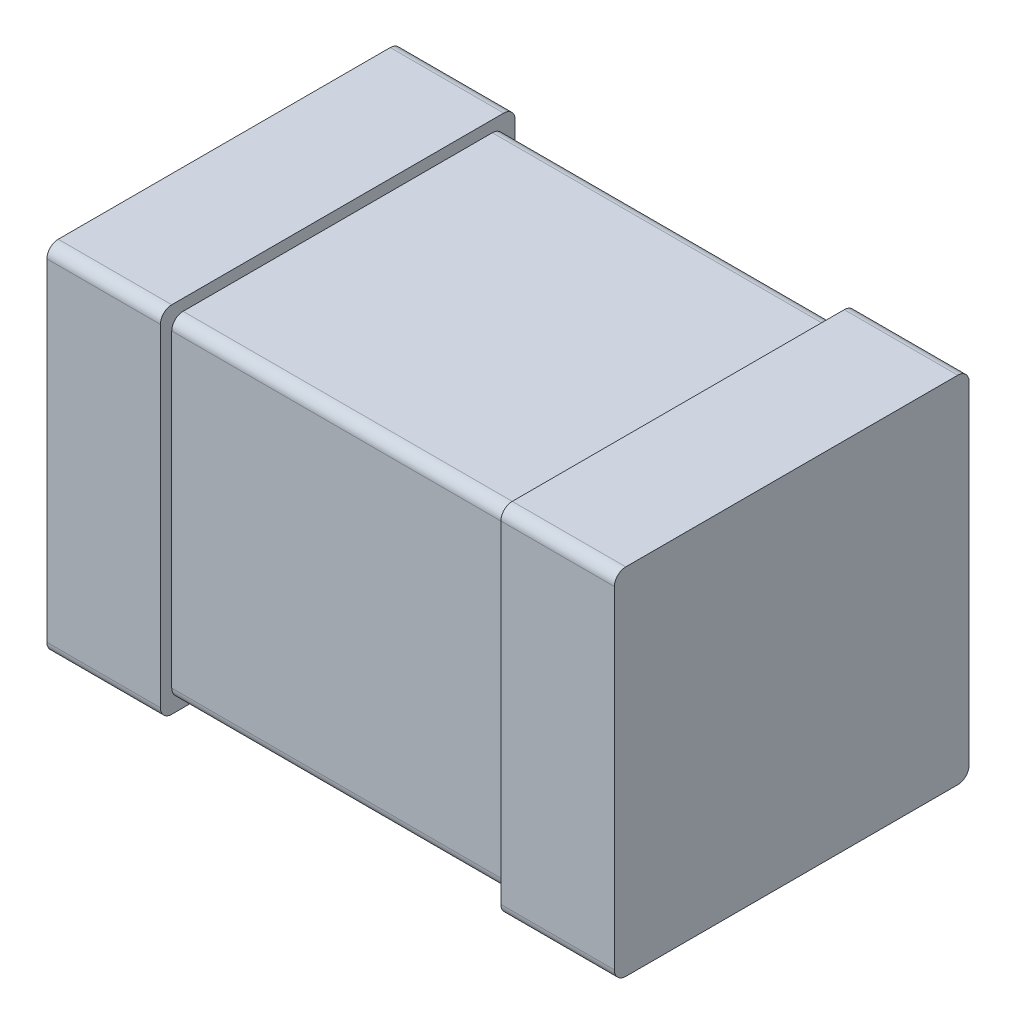
ISO-10303-21;
HEADER;
FILE_DESCRIPTION(('STEP AP214'),'2;1');
FILE_NAME('part.step','',(''),(''),'','','');
FILE_SCHEMA(('AUTOMOTIVE_DESIGN { 1 0 10303 214 1 1 1 1 }'));
ENDSEC;
DATA;
#1=APPLICATION_CONTEXT('core data for automotive mechanical design processes');
#2=APPLICATION_PROTOCOL_DEFINITION('international standard','automotive_design',2000,#1);
#3=PRODUCT_CONTEXT('',#1,'mechanical');
#4=PRODUCT('Part','Part','',(#3));
#5=PRODUCT_RELATED_PRODUCT_CATEGORY('part','',(#4));
#6=PRODUCT_DEFINITION_FORMATION('','',#4);
#7=PRODUCT_DEFINITION_CONTEXT('part definition',#1,'design');
#8=PRODUCT_DEFINITION('design','',#6,#7);
#9=PRODUCT_DEFINITION_SHAPE('','',#8);
#10=(LENGTH_UNIT() NAMED_UNIT(*) SI_UNIT(.MILLI.,.METRE.));
#11=(NAMED_UNIT(*) PLANE_ANGLE_UNIT() SI_UNIT($,.RADIAN.));
#12=(NAMED_UNIT(*) SI_UNIT($,.STERADIAN.) SOLID_ANGLE_UNIT());
#13=UNCERTAINTY_MEASURE_WITH_UNIT(LENGTH_MEASURE(1.E-05),#10,'distance_accuracy_value','');
#14=(GEOMETRIC_REPRESENTATION_CONTEXT(3) GLOBAL_UNCERTAINTY_ASSIGNED_CONTEXT((#13)) GLOBAL_UNIT_ASSIGNED_CONTEXT((#10,
#11,#12)) REPRESENTATION_CONTEXT('',''));
#15=CARTESIAN_POINT('',(0.,0.,0.));
#16=DIRECTION('',(0.,0.,1.));
#17=DIRECTION('',(1.,0.,0.));
#18=AXIS2_PLACEMENT_3D('',#15,#16,#17);
#19=CARTESIAN_POINT('',(-1.,-0.625,0.));
#20=DIRECTION('',(1.,0.,0.));
#21=DIRECTION('',(0.,0.,1.));
#22=AXIS2_PLACEMENT_3D('',#19,#20,#21);
#23=PLANE('',#22);
#24=CARTESIAN_POINT('',(-1.,-0.585,1.21));
#25=DIRECTION('',(-1.,0.,0.));
#26=DIRECTION('',(0.,0.,1.));
#27=AXIS2_PLACEMENT_3D('',#24,#25,#26);
#28=CIRCLE('',#27,0.04);
#29=CARTESIAN_POINT('',(-1.,-0.625,1.21));
#30=VERTEX_POINT('',#29);
#31=CARTESIAN_POINT('',(-1.,-0.585,1.25));
#32=VERTEX_POINT('',#31);
#33=EDGE_CURVE('E11',#30,#32,#28,.T.);
#34=ORIENTED_EDGE('',*,*,#33,.T.);
#35=DIRECTION('',(0.,1.,0.));
#36=VECTOR('',#35,1.);
#37=CARTESIAN_POINT('',(-1.,-0.625,1.25));
#38=LINE('',#37,#36);
#39=CARTESIAN_POINT('',(-1.,0.585,1.25));
#40=VERTEX_POINT('',#39);
#41=EDGE_CURVE('E25',#32,#40,#38,.T.);
#42=ORIENTED_EDGE('',*,*,#41,.T.);
#43=CARTESIAN_POINT('',(-1.,0.585,1.21));
#44=DIRECTION('',(1.,0.,0.));
#45=DIRECTION('',(0.,0.,1.));
#46=AXIS2_PLACEMENT_3D('',#43,#44,#45);
#47=CIRCLE('',#46,0.04);
#48=CARTESIAN_POINT('',(-1.,0.625,1.21));
#49=VERTEX_POINT('',#48);
#50=EDGE_CURVE('E450',#49,#40,#47,.T.);
#51=ORIENTED_EDGE('',*,*,#50,.F.);
#52=DIRECTION('',(0.,0.,1.));
#53=VECTOR('',#52,1.);
#54=CARTESIAN_POINT('',(-1.,0.625,0.));
#55=LINE('',#54,#53);
#56=CARTESIAN_POINT('',(-1.,0.625,0.04));
#57=VERTEX_POINT('',#56);
#58=EDGE_CURVE('E445',#57,#49,#55,.T.);
#59=ORIENTED_EDGE('',*,*,#58,.F.);
#60=CARTESIAN_POINT('',(-1.,0.585,0.04));
#61=DIRECTION('',(-1.,0.,0.));
#62=DIRECTION('',(0.,0.,1.));
#63=AXIS2_PLACEMENT_3D('',#60,#61,#62);
#64=CIRCLE('',#63,0.04);
#65=CARTESIAN_POINT('',(-1.,0.585,0.));
#66=VERTEX_POINT('',#65);
#67=EDGE_CURVE('E441',#57,#66,#64,.T.);
#68=ORIENTED_EDGE('',*,*,#67,.T.);
#69=DIRECTION('',(0.,1.,0.));
#70=VECTOR('',#69,1.);
#71=CARTESIAN_POINT('',(-1.,-0.625,0.));
#72=LINE('',#71,#70);
#73=CARTESIAN_POINT('',(-1.,-0.585,0.));
#74=VERTEX_POINT('',#73);
#75=EDGE_CURVE('E436',#74,#66,#72,.T.);
#76=ORIENTED_EDGE('',*,*,#75,.F.);
#77=CARTESIAN_POINT('',(-1.,-0.585,0.04));
#78=DIRECTION('',(1.,0.,0.));
#79=DIRECTION('',(0.,0.,1.));
#80=AXIS2_PLACEMENT_3D('',#77,#78,#79);
#81=CIRCLE('',#80,0.04);
#82=CARTESIAN_POINT('',(-1.,-0.625,0.04));
#83=VERTEX_POINT('',#82);
#84=EDGE_CURVE('E431',#83,#74,#81,.T.);
#85=ORIENTED_EDGE('',*,*,#84,.F.);
#86=DIRECTION('',(0.,0.,1.));
#87=VECTOR('',#86,1.);
#88=CARTESIAN_POINT('',(-1.,-0.625,0.));
#89=LINE('',#88,#87);
#90=EDGE_CURVE('E427',#83,#30,#89,.T.);
#91=ORIENTED_EDGE('',*,*,#90,.T.);
#92=EDGE_LOOP('',(#34,#42,#51,#59,#68,#76,#85,#91));
#93=FACE_BOUND('',#92,.T.);
#94=ADVANCED_FACE('F17',(#93),#23,.F.);
#95=CARTESIAN_POINT('',(-1.,-0.625,0.));
#96=DIRECTION('',(0.,1.,0.));
#97=DIRECTION('',(0.,0.,1.));
#98=AXIS2_PLACEMENT_3D('',#95,#96,#97);
#99=PLANE('',#98);
#100=DIRECTION('',(1.,0.,0.));
#101=VECTOR('',#100,1.);
#102=CARTESIAN_POINT('',(-1.,-0.625,1.21));
#103=LINE('',#102,#101);
#104=CARTESIAN_POINT('',(-0.6,-0.625,1.21));
#105=VERTEX_POINT('',#104);
#106=EDGE_CURVE('E422',#30,#105,#103,.T.);
#107=ORIENTED_EDGE('',*,*,#106,.F.);
#108=ORIENTED_EDGE('',*,*,#90,.F.);
#109=DIRECTION('',(1.,0.,0.));
#110=VECTOR('',#109,1.);
#111=CARTESIAN_POINT('',(-1.,-0.625,0.04));
#112=LINE('',#111,#110);
#113=CARTESIAN_POINT('',(-0.6,-0.625,0.04));
#114=VERTEX_POINT('',#113);
#115=EDGE_CURVE('E418',#83,#114,#112,.T.);
#116=ORIENTED_EDGE('',*,*,#115,.T.);
#117=DIRECTION('',(0.,0.,1.));
#118=VECTOR('',#117,1.);
#119=CARTESIAN_POINT('',(-0.6,-0.625,0.));
#120=LINE('',#119,#118);
#121=EDGE_CURVE('E414',#114,#105,#120,.T.);
#122=ORIENTED_EDGE('',*,*,#121,.T.);
#123=EDGE_LOOP('',(#107,#108,#116,#122));
#124=FACE_BOUND('',#123,.T.);
#125=ADVANCED_FACE('F495',(#124),#99,.F.);
#126=CARTESIAN_POINT('',(-0.6,-0.625,0.));
#127=DIRECTION('',(1.,0.,0.));
#128=DIRECTION('',(0.,0.,1.));
#129=AXIS2_PLACEMENT_3D('',#126,#127,#128);
#130=PLANE('',#129);
#131=ORIENTED_EDGE('',*,*,#121,.F.);
#132=CARTESIAN_POINT('',(-0.6,-0.585,0.04));
#133=DIRECTION('',(1.,0.,0.));
#134=DIRECTION('',(0.,0.,1.));
#135=AXIS2_PLACEMENT_3D('',#132,#133,#134);
#136=CIRCLE('',#135,0.04);
#137=CARTESIAN_POINT('',(-0.6,-0.585,0.));
#138=VERTEX_POINT('',#137);
#139=EDGE_CURVE('E410',#114,#138,#136,.T.);
#140=ORIENTED_EDGE('',*,*,#139,.T.);
#141=DIRECTION('',(0.,1.,0.));
#142=VECTOR('',#141,1.);
#143=CARTESIAN_POINT('',(-0.6,-0.625,0.));
#144=LINE('',#143,#142);
#145=CARTESIAN_POINT('',(-0.6,0.585,0.));
#146=VERTEX_POINT('',#145);
#147=EDGE_CURVE('E406',#138,#146,#144,.T.);
#148=ORIENTED_EDGE('',*,*,#147,.T.);
#149=CARTESIAN_POINT('',(-0.6,0.585,0.04));
#150=DIRECTION('',(-1.,0.,0.));
#151=DIRECTION('',(0.,0.,1.));
#152=AXIS2_PLACEMENT_3D('',#149,#150,#151);
#153=CIRCLE('',#152,0.04);
#154=CARTESIAN_POINT('',(-0.6,0.625,0.04));
#155=VERTEX_POINT('',#154);
#156=EDGE_CURVE('E401',#155,#146,#153,.T.);
#157=ORIENTED_EDGE('',*,*,#156,.F.);
#158=DIRECTION('',(0.,0.,1.));
#159=VECTOR('',#158,1.);
#160=CARTESIAN_POINT('',(-0.6,0.625,0.));
#161=LINE('',#160,#159);
#162=CARTESIAN_POINT('',(-0.6,0.625,1.21));
#163=VERTEX_POINT('',#162);
#164=EDGE_CURVE('E397',#155,#163,#161,.T.);
#165=ORIENTED_EDGE('',*,*,#164,.T.);
#166=CARTESIAN_POINT('',(-0.6,0.585,1.21));
#167=DIRECTION('',(1.,0.,0.));
#168=DIRECTION('',(0.,0.,1.));
#169=AXIS2_PLACEMENT_3D('',#166,#167,#168);
#170=CIRCLE('',#169,0.04);
#171=CARTESIAN_POINT('',(-0.6,0.585,1.25));
#172=VERTEX_POINT('',#171);
#173=EDGE_CURVE('E393',#163,#172,#170,.T.);
#174=ORIENTED_EDGE('',*,*,#173,.T.);
#175=DIRECTION('',(0.,1.,0.));
#176=VECTOR('',#175,1.);
#177=CARTESIAN_POINT('',(-0.6,-0.625,1.25));
#178=LINE('',#177,#176);
#179=CARTESIAN_POINT('',(-0.6,-0.585,1.25));
#180=VERTEX_POINT('',#179);
#181=EDGE_CURVE('E388',#180,#172,#178,.T.);
#182=ORIENTED_EDGE('',*,*,#181,.F.);
#183=CARTESIAN_POINT('',(-0.6,-0.585,1.21));
#184=DIRECTION('',(-1.,0.,0.));
#185=DIRECTION('',(0.,0.,1.));
#186=AXIS2_PLACEMENT_3D('',#183,#184,#185);
#187=CIRCLE('',#186,0.04);
#188=EDGE_CURVE('E383',#105,#180,#187,.T.);
#189=ORIENTED_EDGE('',*,*,#188,.F.);
#190=EDGE_LOOP('',(#131,#140,#148,#157,#165,#174,#182,#189));
#191=FACE_BOUND('',#190,.T.);
#192=CARTESIAN_POINT('',(-0.6,-0.545,0.08));
#193=DIRECTION('',(1.,0.,0.));
#194=DIRECTION('',(0.,0.,1.));
#195=AXIS2_PLACEMENT_3D('',#192,#193,#194);
#196=CIRCLE('',#195,0.04);
#197=CARTESIAN_POINT('',(-0.6,-0.585,0.08));
#198=VERTEX_POINT('',#197);
#199=CARTESIAN_POINT('',(-0.6,-0.545,0.04));
#200=VERTEX_POINT('',#199);
#201=EDGE_CURVE('E378',#198,#200,#196,.T.);
#202=ORIENTED_EDGE('',*,*,#201,.F.);
#203=DIRECTION('',(0.,0.,1.));
#204=VECTOR('',#203,1.);
#205=CARTESIAN_POINT('',(-0.6,-0.585,0.04));
#206=LINE('',#205,#204);
#207=CARTESIAN_POINT('',(-0.6,-0.585,1.17));
#208=VERTEX_POINT('',#207);
#209=EDGE_CURVE('E374',#198,#208,#206,.T.);
#210=ORIENTED_EDGE('',*,*,#209,.T.);
#211=CARTESIAN_POINT('',(-0.6,-0.545,1.17));
#212=DIRECTION('',(-1.,0.,0.));
#213=DIRECTION('',(0.,0.,1.));
#214=AXIS2_PLACEMENT_3D('',#211,#212,#213);
#215=CIRCLE('',#214,0.04);
#216=CARTESIAN_POINT('',(-0.6,-0.545,1.21));
#217=VERTEX_POINT('',#216);
#218=EDGE_CURVE('E370',#208,#217,#215,.T.);
#219=ORIENTED_EDGE('',*,*,#218,.T.);
#220=DIRECTION('',(0.,1.,0.));
#221=VECTOR('',#220,1.);
#222=CARTESIAN_POINT('',(-0.6,-0.585,1.21));
#223=LINE('',#222,#221);
#224=CARTESIAN_POINT('',(-0.6,0.545,1.21));
#225=VERTEX_POINT('',#224);
#226=EDGE_CURVE('E366',#217,#225,#223,.T.);
#227=ORIENTED_EDGE('',*,*,#226,.T.);
#228=CARTESIAN_POINT('',(-0.6,0.545,1.17));
#229=DIRECTION('',(1.,0.,0.));
#230=DIRECTION('',(0.,0.,1.));
#231=AXIS2_PLACEMENT_3D('',#228,#229,#230);
#232=CIRCLE('',#231,0.04);
#233=CARTESIAN_POINT('',(-0.6,0.585,1.17));
#234=VERTEX_POINT('',#233);
#235=EDGE_CURVE('E361',#234,#225,#232,.T.);
#236=ORIENTED_EDGE('',*,*,#235,.F.);
#237=DIRECTION('',(0.,0.,1.));
#238=VECTOR('',#237,1.);
#239=CARTESIAN_POINT('',(-0.6,0.585,0.04));
#240=LINE('',#239,#238);
#241=CARTESIAN_POINT('',(-0.6,0.585,0.08));
#242=VERTEX_POINT('',#241);
#243=EDGE_CURVE('E356',#242,#234,#240,.T.);
#244=ORIENTED_EDGE('',*,*,#243,.F.);
#245=CARTESIAN_POINT('',(-0.6,0.545,0.08));
#246=DIRECTION('',(-1.,0.,0.));
#247=DIRECTION('',(0.,0.,1.));
#248=AXIS2_PLACEMENT_3D('',#245,#246,#247);
#249=CIRCLE('',#248,0.04);
#250=CARTESIAN_POINT('',(-0.6,0.545,0.04));
#251=VERTEX_POINT('',#250);
#252=EDGE_CURVE('E352',#242,#251,#249,.T.);
#253=ORIENTED_EDGE('',*,*,#252,.T.);
#254=DIRECTION('',(0.,1.,0.));
#255=VECTOR('',#254,1.);
#256=CARTESIAN_POINT('',(-0.6,-0.585,0.04));
#257=LINE('',#256,#255);
#258=EDGE_CURVE('E347',#200,#251,#257,.T.);
#259=ORIENTED_EDGE('',*,*,#258,.F.);
#260=EDGE_LOOP('',(#202,#210,#219,#227,#236,#244,#253,#259));
#261=FACE_BOUND('',#260,.T.);
#262=ADVANCED_FACE('F573',(#191,#261),#130,.T.);
#263=CARTESIAN_POINT('',(-0.6,-0.585,0.04));
#264=DIRECTION('',(0.,0.,1.));
#265=DIRECTION('',(1.,0.,0.));
#266=AXIS2_PLACEMENT_3D('',#263,#264,#265);
#267=PLANE('',#266);
#268=DIRECTION('',(1.,0.,0.));
#269=VECTOR('',#268,1.);
#270=CARTESIAN_POINT('',(-0.6,0.545,0.04));
#271=LINE('',#270,#269);
#272=CARTESIAN_POINT('',(0.6,0.545,0.04));
#273=VERTEX_POINT('',#272);
#274=EDGE_CURVE('E343',#251,#273,#271,.T.);
#275=ORIENTED_EDGE('',*,*,#274,.T.);
#276=DIRECTION('',(0.,1.,0.));
#277=VECTOR('',#276,1.);
#278=CARTESIAN_POINT('',(0.6,-0.585,0.04));
#279=LINE('',#278,#277);
#280=CARTESIAN_POINT('',(0.6,-0.545,0.04));
#281=VERTEX_POINT('',#280);
#282=EDGE_CURVE('E338',#281,#273,#279,.T.);
#283=ORIENTED_EDGE('',*,*,#282,.F.);
#284=DIRECTION('',(1.,0.,0.));
#285=VECTOR('',#284,1.);
#286=CARTESIAN_POINT('',(-0.6,-0.545,0.04));
#287=LINE('',#286,#285);
#288=EDGE_CURVE('E333',#200,#281,#287,.T.);
#289=ORIENTED_EDGE('',*,*,#288,.F.);
#290=ORIENTED_EDGE('',*,*,#258,.T.);
#291=EDGE_LOOP('',(#275,#283,#289,#290));
#292=FACE_BOUND('',#291,.T.);
#293=ADVANCED_FACE('F577',(#292),#267,.F.);
#294=CARTESIAN_POINT('',(-0.6,-0.545,0.08));
#295=DIRECTION('',(1.,0.,0.));
#296=DIRECTION('',(0.,0.707106781186547,0.707106781186548));
#297=AXIS2_PLACEMENT_3D('',#294,#295,#296);
#298=CYLINDRICAL_SURFACE('',#297,0.04);
#299=ORIENTED_EDGE('',*,*,#201,.T.);
#300=ORIENTED_EDGE('',*,*,#288,.T.);
#301=CARTESIAN_POINT('',(0.6,-0.545,0.08));
#302=DIRECTION('',(1.,0.,0.));
#303=DIRECTION('',(0.,0.,1.));
#304=AXIS2_PLACEMENT_3D('',#301,#302,#303);
#305=CIRCLE('',#304,0.04);
#306=CARTESIAN_POINT('',(0.6,-0.585,0.08));
#307=VERTEX_POINT('',#306);
#308=EDGE_CURVE('E328',#307,#281,#305,.T.);
#309=ORIENTED_EDGE('',*,*,#308,.F.);
#310=DIRECTION('',(1.,0.,0.));
#311=VECTOR('',#310,1.);
#312=CARTESIAN_POINT('',(-0.6,-0.585,0.08));
#313=LINE('',#312,#311);
#314=EDGE_CURVE('E323',#198,#307,#313,.T.);
#315=ORIENTED_EDGE('',*,*,#314,.F.);
#316=EDGE_LOOP('',(#299,#300,#309,#315));
#317=FACE_BOUND('',#316,.T.);
#318=ADVANCED_FACE('F583',(#317),#298,.T.);
#319=CARTESIAN_POINT('',(-0.6,-0.585,0.04));
#320=DIRECTION('',(0.,1.,0.));
#321=DIRECTION('',(0.,0.,1.));
#322=AXIS2_PLACEMENT_3D('',#319,#320,#321);
#323=PLANE('',#322);
#324=DIRECTION('',(1.,0.,0.));
#325=VECTOR('',#324,1.);
#326=CARTESIAN_POINT('',(-0.6,-0.585,1.17));
#327=LINE('',#326,#325);
#328=CARTESIAN_POINT('',(0.6,-0.585,1.17));
#329=VERTEX_POINT('',#328);
#330=EDGE_CURVE('E318',#208,#329,#327,.T.);
#331=ORIENTED_EDGE('',*,*,#330,.F.);
#332=ORIENTED_EDGE('',*,*,#209,.F.);
#333=ORIENTED_EDGE('',*,*,#314,.T.);
#334=DIRECTION('',(0.,0.,1.));
#335=VECTOR('',#334,1.);
#336=CARTESIAN_POINT('',(0.6,-0.585,0.04));
#337=LINE('',#336,#335);
#338=EDGE_CURVE('E314',#307,#329,#337,.T.);
#339=ORIENTED_EDGE('',*,*,#338,.T.);
#340=EDGE_LOOP('',(#331,#332,#333,#339));
#341=FACE_BOUND('',#340,.T.);
#342=ADVANCED_FACE('F587',(#341),#323,.F.);
#343=CARTESIAN_POINT('',(0.6,-0.625,0.));
#344=DIRECTION('',(1.,0.,0.));
#345=DIRECTION('',(0.,0.,1.));
#346=AXIS2_PLACEMENT_3D('',#343,#344,#345);
#347=PLANE('',#346);
#348=CARTESIAN_POINT('',(0.6,-0.585,1.21));
#349=DIRECTION('',(-1.,0.,0.));
#350=DIRECTION('',(0.,0.,1.));
#351=AXIS2_PLACEMENT_3D('',#348,#349,#350);
#352=CIRCLE('',#351,0.04);
#353=CARTESIAN_POINT('',(0.6,-0.625,1.21));
#354=VERTEX_POINT('',#353);
#355=CARTESIAN_POINT('',(0.6,-0.585,1.25));
#356=VERTEX_POINT('',#355);
#357=EDGE_CURVE('E310',#354,#356,#352,.T.);
#358=ORIENTED_EDGE('',*,*,#357,.T.);
#359=DIRECTION('',(0.,1.,0.));
#360=VECTOR('',#359,1.);
#361=CARTESIAN_POINT('',(0.6,-0.625,1.25));
#362=LINE('',#361,#360);
#363=CARTESIAN_POINT('',(0.6,0.585,1.25));
#364=VERTEX_POINT('',#363);
#365=EDGE_CURVE('E191',#356,#364,#362,.T.);
#366=ORIENTED_EDGE('',*,*,#365,.T.);
#367=CARTESIAN_POINT('',(0.6,0.585,1.21));
#368=DIRECTION('',(1.,0.,0.));
#369=DIRECTION('',(0.,0.,1.));
#370=AXIS2_PLACEMENT_3D('',#367,#368,#369);
#371=CIRCLE('',#370,0.04);
#372=CARTESIAN_POINT('',(0.6,0.625,1.21));
#373=VERTEX_POINT('',#372);
#374=EDGE_CURVE('E302',#373,#364,#371,.T.);
#375=ORIENTED_EDGE('',*,*,#374,.F.);
#376=DIRECTION('',(0.,0.,1.));
#377=VECTOR('',#376,1.);
#378=CARTESIAN_POINT('',(0.6,0.625,0.));
#379=LINE('',#378,#377);
#380=CARTESIAN_POINT('',(0.6,0.625,0.04));
#381=VERTEX_POINT('',#380);
#382=EDGE_CURVE('E297',#381,#373,#379,.T.);
#383=ORIENTED_EDGE('',*,*,#382,.F.);
#384=CARTESIAN_POINT('',(0.6,0.585,0.04));
#385=DIRECTION('',(-1.,0.,0.));
#386=DIRECTION('',(0.,0.,1.));
#387=AXIS2_PLACEMENT_3D('',#384,#385,#386);
#388=CIRCLE('',#387,0.04);
#389=CARTESIAN_POINT('',(0.6,0.585,0.));
#390=VERTEX_POINT('',#389);
#391=EDGE_CURVE('E293',#381,#390,#388,.T.);
#392=ORIENTED_EDGE('',*,*,#391,.T.);
#393=DIRECTION('',(0.,1.,0.));
#394=VECTOR('',#393,1.);
#395=CARTESIAN_POINT('',(0.6,-0.625,0.));
#396=LINE('',#395,#394);
#397=CARTESIAN_POINT('',(0.6,-0.585,0.));
#398=VERTEX_POINT('',#397);
#399=EDGE_CURVE('E288',#398,#390,#396,.T.);
#400=ORIENTED_EDGE('',*,*,#399,.F.);
#401=CARTESIAN_POINT('',(0.6,-0.585,0.04));
#402=DIRECTION('',(1.,0.,0.));
#403=DIRECTION('',(0.,0.,1.));
#404=AXIS2_PLACEMENT_3D('',#401,#402,#403);
#405=CIRCLE('',#404,0.04);
#406=CARTESIAN_POINT('',(0.6,-0.625,0.04));
#407=VERTEX_POINT('',#406);
#408=EDGE_CURVE('E283',#407,#398,#405,.T.);
#409=ORIENTED_EDGE('',*,*,#408,.F.);
#410=DIRECTION('',(0.,0.,1.));
#411=VECTOR('',#410,1.);
#412=CARTESIAN_POINT('',(0.6,-0.625,0.));
#413=LINE('',#412,#411);
#414=EDGE_CURVE('E279',#407,#354,#413,.T.);
#415=ORIENTED_EDGE('',*,*,#414,.T.);
#416=EDGE_LOOP('',(#358,#366,#375,#383,#392,#400,#409,#415));
#417=FACE_BOUND('',#416,.T.);
#418=ORIENTED_EDGE('',*,*,#282,.T.);
#419=CARTESIAN_POINT('',(0.6,0.545,0.08));
#420=DIRECTION('',(-1.,0.,0.));
#421=DIRECTION('',(0.,0.,1.));
#422=AXIS2_PLACEMENT_3D('',#419,#420,#421);
#423=CIRCLE('',#422,0.04);
#424=CARTESIAN_POINT('',(0.6,0.585,0.08));
#425=VERTEX_POINT('',#424);
#426=EDGE_CURVE('E274',#425,#273,#423,.T.);
#427=ORIENTED_EDGE('',*,*,#426,.F.);
#428=DIRECTION('',(0.,0.,1.));
#429=VECTOR('',#428,1.);
#430=CARTESIAN_POINT('',(0.6,0.585,0.04));
#431=LINE('',#430,#429);
#432=CARTESIAN_POINT('',(0.6,0.585,1.17));
#433=VERTEX_POINT('',#432);
#434=EDGE_CURVE('E270',#425,#433,#431,.T.);
#435=ORIENTED_EDGE('',*,*,#434,.T.);
#436=CARTESIAN_POINT('',(0.6,0.545,1.17));
#437=DIRECTION('',(1.,0.,0.));
#438=DIRECTION('',(0.,0.,1.));
#439=AXIS2_PLACEMENT_3D('',#436,#437,#438);
#440=CIRCLE('',#439,0.04);
#441=CARTESIAN_POINT('',(0.6,0.545,1.21));
#442=VERTEX_POINT('',#441);
#443=EDGE_CURVE('E266',#433,#442,#440,.T.);
#444=ORIENTED_EDGE('',*,*,#443,.T.);
#445=DIRECTION('',(0.,1.,0.));
#446=VECTOR('',#445,1.);
#447=CARTESIAN_POINT('',(0.6,-0.585,1.21));
#448=LINE('',#447,#446);
#449=CARTESIAN_POINT('',(0.6,-0.545,1.21));
#450=VERTEX_POINT('',#449);
#451=EDGE_CURVE('E261',#450,#442,#448,.T.);
#452=ORIENTED_EDGE('',*,*,#451,.F.);
#453=CARTESIAN_POINT('',(0.6,-0.545,1.17));
#454=DIRECTION('',(-1.,0.,0.));
#455=DIRECTION('',(0.,0.,1.));
#456=AXIS2_PLACEMENT_3D('',#453,#454,#455);
#457=CIRCLE('',#456,0.04);
#458=EDGE_CURVE('E256',#329,#450,#457,.T.);
#459=ORIENTED_EDGE('',*,*,#458,.F.);
#460=ORIENTED_EDGE('',*,*,#338,.F.);
#461=ORIENTED_EDGE('',*,*,#308,.T.);
#462=EDGE_LOOP('',(#418,#427,#435,#444,#452,#459,#460,#461));
#463=FACE_BOUND('',#462,.T.);
#464=ADVANCED_FACE('F539',(#417,#463),#347,.F.);
#465=CARTESIAN_POINT('',(-0.6,-0.545,1.17));
#466=DIRECTION('',(1.,0.,0.));
#467=DIRECTION('',(0.,0.707106781186547,-0.707106781186548));
#468=AXIS2_PLACEMENT_3D('',#465,#466,#467);
#469=CYLINDRICAL_SURFACE('',#468,0.04);
#470=ORIENTED_EDGE('',*,*,#330,.T.);
#471=ORIENTED_EDGE('',*,*,#458,.T.);
#472=DIRECTION('',(1.,0.,0.));
#473=VECTOR('',#472,1.);
#474=CARTESIAN_POINT('',(-0.6,-0.545,1.21));
#475=LINE('',#474,#473);
#476=EDGE_CURVE('E251',#217,#450,#475,.T.);
#477=ORIENTED_EDGE('',*,*,#476,.F.);
#478=ORIENTED_EDGE('',*,*,#218,.F.);
#479=EDGE_LOOP('',(#470,#471,#477,#478));
#480=FACE_BOUND('',#479,.T.);
#481=ADVANCED_FACE('F594',(#480),#469,.T.);
#482=CARTESIAN_POINT('',(-0.6,-0.585,1.21));
#483=DIRECTION('',(0.,0.,1.));
#484=DIRECTION('',(1.,0.,0.));
#485=AXIS2_PLACEMENT_3D('',#482,#483,#484);
#486=PLANE('',#485);
#487=ORIENTED_EDGE('',*,*,#226,.F.);
#488=ORIENTED_EDGE('',*,*,#476,.T.);
#489=ORIENTED_EDGE('',*,*,#451,.T.);
#490=DIRECTION('',(1.,0.,0.));
#491=VECTOR('',#490,1.);
#492=CARTESIAN_POINT('',(-0.6,0.545,1.21));
#493=LINE('',#492,#491);
#494=EDGE_CURVE('E246',#225,#442,#493,.T.);
#495=ORIENTED_EDGE('',*,*,#494,.F.);
#496=EDGE_LOOP('',(#487,#488,#489,#495));
#497=FACE_BOUND('',#496,.T.);
#498=ADVANCED_FACE('F597',(#497),#486,.T.);
#499=CARTESIAN_POINT('',(-0.6,0.545,1.17));
#500=DIRECTION('',(1.,0.,0.));
#501=DIRECTION('',(0.,-0.707106781186547,-0.707106781186548));
#502=AXIS2_PLACEMENT_3D('',#499,#500,#501);
#503=CYLINDRICAL_SURFACE('',#502,0.04);
#504=ORIENTED_EDGE('',*,*,#235,.T.);
#505=ORIENTED_EDGE('',*,*,#494,.T.);
#506=ORIENTED_EDGE('',*,*,#443,.F.);
#507=DIRECTION('',(1.,0.,0.));
#508=VECTOR('',#507,1.);
#509=CARTESIAN_POINT('',(-0.6,0.585,1.17));
#510=LINE('',#509,#508);
#511=EDGE_CURVE('E241',#234,#433,#510,.T.);
#512=ORIENTED_EDGE('',*,*,#511,.F.);
#513=EDGE_LOOP('',(#504,#505,#506,#512));
#514=FACE_BOUND('',#513,.T.);
#515=ADVANCED_FACE('F601',(#514),#503,.T.);
#516=CARTESIAN_POINT('',(-0.6,0.585,0.04));
#517=DIRECTION('',(0.,1.,0.));
#518=DIRECTION('',(0.,0.,1.));
#519=AXIS2_PLACEMENT_3D('',#516,#517,#518);
#520=PLANE('',#519);
#521=ORIENTED_EDGE('',*,*,#434,.F.);
#522=DIRECTION('',(1.,0.,0.));
#523=VECTOR('',#522,1.);
#524=CARTESIAN_POINT('',(-0.6,0.585,0.08));
#525=LINE('',#524,#523);
#526=EDGE_CURVE('E236',#242,#425,#525,.T.);
#527=ORIENTED_EDGE('',*,*,#526,.F.);
#528=ORIENTED_EDGE('',*,*,#243,.T.);
#529=ORIENTED_EDGE('',*,*,#511,.T.);
#530=EDGE_LOOP('',(#521,#527,#528,#529));
#531=FACE_BOUND('',#530,.T.);
#532=ADVANCED_FACE('F605',(#531),#520,.T.);
#533=CARTESIAN_POINT('',(-0.6,0.545,0.08));
#534=DIRECTION('',(1.,0.,0.));
#535=DIRECTION('',(0.,-0.707106781186547,0.707106781186548));
#536=AXIS2_PLACEMENT_3D('',#533,#534,#535);
#537=CYLINDRICAL_SURFACE('',#536,0.04);
#538=ORIENTED_EDGE('',*,*,#526,.T.);
#539=ORIENTED_EDGE('',*,*,#426,.T.);
#540=ORIENTED_EDGE('',*,*,#274,.F.);
#541=ORIENTED_EDGE('',*,*,#252,.F.);
#542=EDGE_LOOP('',(#538,#539,#540,#541));
#543=FACE_BOUND('',#542,.T.);
#544=ADVANCED_FACE('F609',(#543),#537,.T.);
#545=CARTESIAN_POINT('',(0.6,-0.625,0.));
#546=DIRECTION('',(0.,1.,0.));
#547=DIRECTION('',(0.,0.,1.));
#548=AXIS2_PLACEMENT_3D('',#545,#546,#547);
#549=PLANE('',#548);
#550=DIRECTION('',(1.,0.,0.));
#551=VECTOR('',#550,1.);
#552=CARTESIAN_POINT('',(0.6,-0.625,1.21));
#553=LINE('',#552,#551);
#554=CARTESIAN_POINT('',(1.,-0.625,1.21));
#555=VERTEX_POINT('',#554);
#556=EDGE_CURVE('E198',#354,#555,#553,.T.);
#557=ORIENTED_EDGE('',*,*,#556,.F.);
#558=ORIENTED_EDGE('',*,*,#414,.F.);
#559=DIRECTION('',(1.,0.,0.));
#560=VECTOR('',#559,1.);
#561=CARTESIAN_POINT('',(0.6,-0.625,0.04));
#562=LINE('',#561,#560);
#563=CARTESIAN_POINT('',(1.,-0.625,0.04));
#564=VERTEX_POINT('',#563);
#565=EDGE_CURVE('E229',#407,#564,#562,.T.);
#566=ORIENTED_EDGE('',*,*,#565,.T.);
#567=DIRECTION('',(0.,0.,1.));
#568=VECTOR('',#567,1.);
#569=CARTESIAN_POINT('',(1.,-0.625,0.));
#570=LINE('',#569,#568);
#571=EDGE_CURVE('E225',#564,#555,#570,.T.);
#572=ORIENTED_EDGE('',*,*,#571,.T.);
#573=EDGE_LOOP('',(#557,#558,#566,#572));
#574=FACE_BOUND('',#573,.T.);
#575=ADVANCED_FACE('F545',(#574),#549,.F.);
#576=CARTESIAN_POINT('',(1.,-0.625,0.));
#577=DIRECTION('',(1.,0.,0.));
#578=DIRECTION('',(0.,0.,1.));
#579=AXIS2_PLACEMENT_3D('',#576,#577,#578);
#580=PLANE('',#579);
#581=ORIENTED_EDGE('',*,*,#571,.F.);
#582=CARTESIAN_POINT('',(1.,-0.585,0.04));
#583=DIRECTION('',(1.,0.,0.));
#584=DIRECTION('',(0.,0.,1.));
#585=AXIS2_PLACEMENT_3D('',#582,#583,#584);
#586=CIRCLE('',#585,0.04);
#587=CARTESIAN_POINT('',(1.,-0.585,0.));
#588=VERTEX_POINT('',#587);
#589=EDGE_CURVE('E221',#564,#588,#586,.T.);
#590=ORIENTED_EDGE('',*,*,#589,.T.);
#591=DIRECTION('',(0.,1.,0.));
#592=VECTOR('',#591,1.);
#593=CARTESIAN_POINT('',(1.,-0.625,0.));
#594=LINE('',#593,#592);
#595=CARTESIAN_POINT('',(1.,0.585,0.));
#596=VERTEX_POINT('',#595);
#597=EDGE_CURVE('E217',#588,#596,#594,.T.);
#598=ORIENTED_EDGE('',*,*,#597,.T.);
#599=CARTESIAN_POINT('',(1.,0.585,0.04));
#600=DIRECTION('',(-1.,0.,0.));
#601=DIRECTION('',(0.,0.,1.));
#602=AXIS2_PLACEMENT_3D('',#599,#600,#601);
#603=CIRCLE('',#602,0.04);
#604=CARTESIAN_POINT('',(1.,0.625,0.04));
#605=VERTEX_POINT('',#604);
#606=EDGE_CURVE('E212',#605,#596,#603,.T.);
#607=ORIENTED_EDGE('',*,*,#606,.F.);
#608=DIRECTION('',(0.,0.,1.));
#609=VECTOR('',#608,1.);
#610=CARTESIAN_POINT('',(1.,0.625,0.));
#611=LINE('',#610,#609);
#612=CARTESIAN_POINT('',(1.,0.625,1.21));
#613=VERTEX_POINT('',#612);
#614=EDGE_CURVE('E208',#605,#613,#611,.T.);
#615=ORIENTED_EDGE('',*,*,#614,.T.);
#616=CARTESIAN_POINT('',(1.,0.585,1.21));
#617=DIRECTION('',(1.,0.,0.));
#618=DIRECTION('',(0.,0.,1.));
#619=AXIS2_PLACEMENT_3D('',#616,#617,#618);
#620=CIRCLE('',#619,0.04);
#621=CARTESIAN_POINT('',(1.,0.585,1.25));
#622=VERTEX_POINT('',#621);
#623=EDGE_CURVE('E182',#613,#622,#620,.T.);
#624=ORIENTED_EDGE('',*,*,#623,.T.);
#625=DIRECTION('',(0.,1.,0.));
#626=VECTOR('',#625,1.);
#627=CARTESIAN_POINT('',(1.,-0.625,1.25));
#628=LINE('',#627,#626);
#629=CARTESIAN_POINT('',(1.,-0.585,1.25));
#630=VERTEX_POINT('',#629);
#631=EDGE_CURVE('E174',#630,#622,#628,.T.);
#632=ORIENTED_EDGE('',*,*,#631,.F.);
#633=CARTESIAN_POINT('',(1.,-0.585,1.21));
#634=DIRECTION('',(-1.,0.,0.));
#635=DIRECTION('',(0.,0.,1.));
#636=AXIS2_PLACEMENT_3D('',#633,#634,#635);
#637=CIRCLE('',#636,0.04);
#638=EDGE_CURVE('E179',#555,#630,#637,.T.);
#639=ORIENTED_EDGE('',*,*,#638,.F.);
#640=EDGE_LOOP('',(#581,#590,#598,#607,#615,#624,#632,#639));
#641=FACE_BOUND('',#640,.T.);
#642=ADVANCED_FACE('F177',(#641),#580,.T.);
#643=CARTESIAN_POINT('',(0.6,-0.585,1.21));
#644=DIRECTION('',(1.,0.,0.));
#645=DIRECTION('',(0.,0.707106781186547,-0.707106781186548));
#646=AXIS2_PLACEMENT_3D('',#643,#644,#645);
#647=CYLINDRICAL_SURFACE('',#646,0.04);
#648=ORIENTED_EDGE('',*,*,#556,.T.);
#649=ORIENTED_EDGE('',*,*,#638,.T.);
#650=DIRECTION('',(1.,0.,0.));
#651=VECTOR('',#650,1.);
#652=CARTESIAN_POINT('',(0.6,-0.585,1.25));
#653=LINE('',#652,#651);
#654=EDGE_CURVE('E189',#356,#630,#653,.T.);
#655=ORIENTED_EDGE('',*,*,#654,.F.);
#656=ORIENTED_EDGE('',*,*,#357,.F.);
#657=EDGE_LOOP('',(#648,#649,#655,#656));
#658=FACE_BOUND('',#657,.T.);
#659=ADVANCED_FACE('F196',(#658),#647,.T.);
#660=CARTESIAN_POINT('',(0.6,-0.625,1.25));
#661=DIRECTION('',(0.,0.,1.));
#662=DIRECTION('',(1.,0.,0.));
#663=AXIS2_PLACEMENT_3D('',#660,#661,#662);
#664=PLANE('',#663);
#665=ORIENTED_EDGE('',*,*,#365,.F.);
#666=ORIENTED_EDGE('',*,*,#654,.T.);
#667=ORIENTED_EDGE('',*,*,#631,.T.);
#668=DIRECTION('',(1.,0.,0.));
#669=VECTOR('',#668,1.);
#670=CARTESIAN_POINT('',(0.6,0.585,1.25));
#671=LINE('',#670,#669);
#672=EDGE_CURVE('E194',#364,#622,#671,.T.);
#673=ORIENTED_EDGE('',*,*,#672,.F.);
#674=EDGE_LOOP('',(#665,#666,#667,#673));
#675=FACE_BOUND('',#674,.T.);
#676=ADVANCED_FACE('F190',(#675),#664,.T.);
#677=CARTESIAN_POINT('',(0.6,0.585,1.21));
#678=DIRECTION('',(1.,0.,0.));
#679=DIRECTION('',(0.,-0.707106781186547,-0.707106781186548));
#680=AXIS2_PLACEMENT_3D('',#677,#678,#679);
#681=CYLINDRICAL_SURFACE('',#680,0.04);
#682=ORIENTED_EDGE('',*,*,#374,.T.);
#683=ORIENTED_EDGE('',*,*,#672,.T.);
#684=ORIENTED_EDGE('',*,*,#623,.F.);
#685=DIRECTION('',(1.,0.,0.));
#686=VECTOR('',#685,1.);
#687=CARTESIAN_POINT('',(0.6,0.625,1.21));
#688=LINE('',#687,#686);
#689=EDGE_CURVE('E526',#373,#613,#688,.T.);
#690=ORIENTED_EDGE('',*,*,#689,.F.);
#691=EDGE_LOOP('',(#682,#683,#684,#690));
#692=FACE_BOUND('',#691,.T.);
#693=ADVANCED_FACE('F536',(#692),#681,.T.);
#694=CARTESIAN_POINT('',(0.6,0.625,0.));
#695=DIRECTION('',(0.,1.,0.));
#696=DIRECTION('',(0.,0.,1.));
#697=AXIS2_PLACEMENT_3D('',#694,#695,#696);
#698=PLANE('',#697);
#699=ORIENTED_EDGE('',*,*,#614,.F.);
#700=DIRECTION('',(1.,0.,0.));
#701=VECTOR('',#700,1.);
#702=CARTESIAN_POINT('',(0.6,0.625,0.04));
#703=LINE('',#702,#701);
#704=EDGE_CURVE('E521',#381,#605,#703,.T.);
#705=ORIENTED_EDGE('',*,*,#704,.F.);
#706=ORIENTED_EDGE('',*,*,#382,.T.);
#707=ORIENTED_EDGE('',*,*,#689,.T.);
#708=EDGE_LOOP('',(#699,#705,#706,#707));
#709=FACE_BOUND('',#708,.T.);
#710=ADVANCED_FACE('F559',(#709),#698,.T.);
#711=CARTESIAN_POINT('',(0.6,0.585,0.04));
#712=DIRECTION('',(1.,0.,0.));
#713=DIRECTION('',(0.,-0.707106781186547,0.707106781186548));
#714=AXIS2_PLACEMENT_3D('',#711,#712,#713);
#715=CYLINDRICAL_SURFACE('',#714,0.04);
#716=ORIENTED_EDGE('',*,*,#704,.T.);
#717=ORIENTED_EDGE('',*,*,#606,.T.);
#718=DIRECTION('',(1.,0.,0.));
#719=VECTOR('',#718,1.);
#720=CARTESIAN_POINT('',(0.6,0.585,0.));
#721=LINE('',#720,#719);
#722=EDGE_CURVE('E516',#390,#596,#721,.T.);
#723=ORIENTED_EDGE('',*,*,#722,.F.);
#724=ORIENTED_EDGE('',*,*,#391,.F.);
#725=EDGE_LOOP('',(#716,#717,#723,#724));
#726=FACE_BOUND('',#725,.T.);
#727=ADVANCED_FACE('F556',(#726),#715,.T.);
#728=CARTESIAN_POINT('',(0.6,-0.625,0.));
#729=DIRECTION('',(0.,0.,1.));
#730=DIRECTION('',(1.,0.,0.));
#731=AXIS2_PLACEMENT_3D('',#728,#729,#730);
#732=PLANE('',#731);
#733=ORIENTED_EDGE('',*,*,#722,.T.);
#734=ORIENTED_EDGE('',*,*,#597,.F.);
#735=DIRECTION('',(1.,0.,0.));
#736=VECTOR('',#735,1.);
#737=CARTESIAN_POINT('',(0.6,-0.585,0.));
#738=LINE('',#737,#736);
#739=EDGE_CURVE('E502',#398,#588,#738,.T.);
#740=ORIENTED_EDGE('',*,*,#739,.F.);
#741=ORIENTED_EDGE('',*,*,#399,.T.);
#742=EDGE_LOOP('',(#733,#734,#740,#741));
#743=FACE_BOUND('',#742,.T.);
#744=ADVANCED_FACE('F552',(#743),#732,.F.);
#745=CARTESIAN_POINT('',(0.6,-0.585,0.04));
#746=DIRECTION('',(1.,0.,0.));
#747=DIRECTION('',(0.,0.707106781186547,0.707106781186548));
#748=AXIS2_PLACEMENT_3D('',#745,#746,#747);
#749=CYLINDRICAL_SURFACE('',#748,0.04);
#750=ORIENTED_EDGE('',*,*,#408,.T.);
#751=ORIENTED_EDGE('',*,*,#739,.T.);
#752=ORIENTED_EDGE('',*,*,#589,.F.);
#753=ORIENTED_EDGE('',*,*,#565,.F.);
#754=EDGE_LOOP('',(#750,#751,#752,#753));
#755=FACE_BOUND('',#754,.T.);
#756=ADVANCED_FACE('F550',(#755),#749,.T.);
#757=CARTESIAN_POINT('',(-1.,-0.585,1.21));
#758=DIRECTION('',(1.,0.,0.));
#759=DIRECTION('',(0.,0.707106781186547,-0.707106781186548));
#760=AXIS2_PLACEMENT_3D('',#757,#758,#759);
#761=CYLINDRICAL_SURFACE('',#760,0.04);
#762=ORIENTED_EDGE('',*,*,#106,.T.);
#763=ORIENTED_EDGE('',*,*,#188,.T.);
#764=DIRECTION('',(1.,0.,0.));
#765=VECTOR('',#764,1.);
#766=CARTESIAN_POINT('',(-1.,-0.585,1.25));
#767=LINE('',#766,#765);
#768=EDGE_CURVE('E500',#32,#180,#767,.T.);
#769=ORIENTED_EDGE('',*,*,#768,.F.);
#770=ORIENTED_EDGE('',*,*,#33,.F.);
#771=EDGE_LOOP('',(#762,#763,#769,#770));
#772=FACE_BOUND('',#771,.T.);
#773=ADVANCED_FACE('F498',(#772),#761,.T.);
#774=CARTESIAN_POINT('',(-1.,-0.625,1.25));
#775=DIRECTION('',(0.,0.,1.));
#776=DIRECTION('',(1.,0.,0.));
#777=AXIS2_PLACEMENT_3D('',#774,#775,#776);
#778=PLANE('',#777);
#779=ORIENTED_EDGE('',*,*,#41,.F.);
#780=ORIENTED_EDGE('',*,*,#768,.T.);
#781=ORIENTED_EDGE('',*,*,#181,.T.);
#782=DIRECTION('',(1.,0.,0.));
#783=VECTOR('',#782,1.);
#784=CARTESIAN_POINT('',(-1.,0.585,1.25));
#785=LINE('',#784,#783);
#786=EDGE_CURVE('E464',#40,#172,#785,.T.);
#787=ORIENTED_EDGE('',*,*,#786,.F.);
#788=EDGE_LOOP('',(#779,#780,#781,#787));
#789=FACE_BOUND('',#788,.T.);
#790=ADVANCED_FACE('F504',(#789),#778,.T.);
#791=CARTESIAN_POINT('',(-1.,0.585,1.21));
#792=DIRECTION('',(1.,0.,0.));
#793=DIRECTION('',(0.,-0.707106781186547,-0.707106781186548));
#794=AXIS2_PLACEMENT_3D('',#791,#792,#793);
#795=CYLINDRICAL_SURFACE('',#794,0.04);
#796=ORIENTED_EDGE('',*,*,#50,.T.);
#797=ORIENTED_EDGE('',*,*,#786,.T.);
#798=ORIENTED_EDGE('',*,*,#173,.F.);
#799=DIRECTION('',(1.,0.,0.));
#800=VECTOR('',#799,1.);
#801=CARTESIAN_POINT('',(-1.,0.625,1.21));
#802=LINE('',#801,#800);
#803=EDGE_CURVE('E466',#49,#163,#802,.T.);
#804=ORIENTED_EDGE('',*,*,#803,.F.);
#805=EDGE_LOOP('',(#796,#797,#798,#804));
#806=FACE_BOUND('',#805,.T.);
#807=ADVANCED_FACE('F462',(#806),#795,.T.);
#808=CARTESIAN_POINT('',(-1.,0.625,0.));
#809=DIRECTION('',(0.,1.,0.));
#810=DIRECTION('',(0.,0.,1.));
#811=AXIS2_PLACEMENT_3D('',#808,#809,#810);
#812=PLANE('',#811);
#813=ORIENTED_EDGE('',*,*,#164,.F.);
#814=DIRECTION('',(1.,0.,0.));
#815=VECTOR('',#814,1.);
#816=CARTESIAN_POINT('',(-1.,0.625,0.04));
#817=LINE('',#816,#815);
#818=EDGE_CURVE('E473',#57,#155,#817,.T.);
#819=ORIENTED_EDGE('',*,*,#818,.F.);
#820=ORIENTED_EDGE('',*,*,#58,.T.);
#821=ORIENTED_EDGE('',*,*,#803,.T.);
#822=EDGE_LOOP('',(#813,#819,#820,#821));
#823=FACE_BOUND('',#822,.T.);
#824=ADVANCED_FACE('F474',(#823),#812,.T.);
#825=CARTESIAN_POINT('',(-1.,0.585,0.04));
#826=DIRECTION('',(1.,0.,0.));
#827=DIRECTION('',(0.,-0.707106781186547,0.707106781186548));
#828=AXIS2_PLACEMENT_3D('',#825,#826,#827);
#829=CYLINDRICAL_SURFACE('',#828,0.04);
#830=ORIENTED_EDGE('',*,*,#818,.T.);
#831=ORIENTED_EDGE('',*,*,#156,.T.);
#832=DIRECTION('',(1.,0.,0.));
#833=VECTOR('',#832,1.);
#834=CARTESIAN_POINT('',(-1.,0.585,0.));
#835=LINE('',#834,#833);
#836=EDGE_CURVE('E476',#66,#146,#835,.T.);
#837=ORIENTED_EDGE('',*,*,#836,.F.);
#838=ORIENTED_EDGE('',*,*,#67,.F.);
#839=EDGE_LOOP('',(#830,#831,#837,#838));
#840=FACE_BOUND('',#839,.T.);
#841=ADVANCED_FACE('F478',(#840),#829,.T.);
#842=CARTESIAN_POINT('',(-1.,-0.625,0.));
#843=DIRECTION('',(0.,0.,1.));
#844=DIRECTION('',(1.,0.,0.));
#845=AXIS2_PLACEMENT_3D('',#842,#843,#844);
#846=PLANE('',#845);
#847=ORIENTED_EDGE('',*,*,#836,.T.);
#848=ORIENTED_EDGE('',*,*,#147,.F.);
#849=DIRECTION('',(1.,0.,0.));
#850=VECTOR('',#849,1.);
#851=CARTESIAN_POINT('',(-1.,-0.585,0.));
#852=LINE('',#851,#850);
#853=EDGE_CURVE('E482',#74,#138,#852,.T.);
#854=ORIENTED_EDGE('',*,*,#853,.F.);
#855=ORIENTED_EDGE('',*,*,#75,.T.);
#856=EDGE_LOOP('',(#847,#848,#854,#855));
#857=FACE_BOUND('',#856,.T.);
#858=ADVANCED_FACE('F485',(#857),#846,.F.);
#859=CARTESIAN_POINT('',(-1.,-0.585,0.04));
#860=DIRECTION('',(1.,0.,0.));
#861=DIRECTION('',(0.,0.707106781186547,0.707106781186548));
#862=AXIS2_PLACEMENT_3D('',#859,#860,#861);
#863=CYLINDRICAL_SURFACE('',#862,0.04);
#864=ORIENTED_EDGE('',*,*,#84,.T.);
#865=ORIENTED_EDGE('',*,*,#853,.T.);
#866=ORIENTED_EDGE('',*,*,#139,.F.);
#867=ORIENTED_EDGE('',*,*,#115,.F.);
#868=EDGE_LOOP('',(#864,#865,#866,#867));
#869=FACE_BOUND('',#868,.T.);
#870=ADVANCED_FACE('F492',(#869),#863,.T.);
#871=CLOSED_SHELL('',(#94,#125,#262,#293,#318,#342,#464,#481,#498,#515,#532,#544,#575,#642,#659,
#676,#693,#710,#727,#744,#756,#773,#790,#807,#824,#841,#858,#870));
#872=MANIFOLD_SOLID_BREP('B1',#871);
#873=ADVANCED_BREP_SHAPE_REPRESENTATION('',(#18,#872),#14);
#874=SHAPE_DEFINITION_REPRESENTATION(#9,#873);
ENDSEC;
END-ISO-10303-21;
